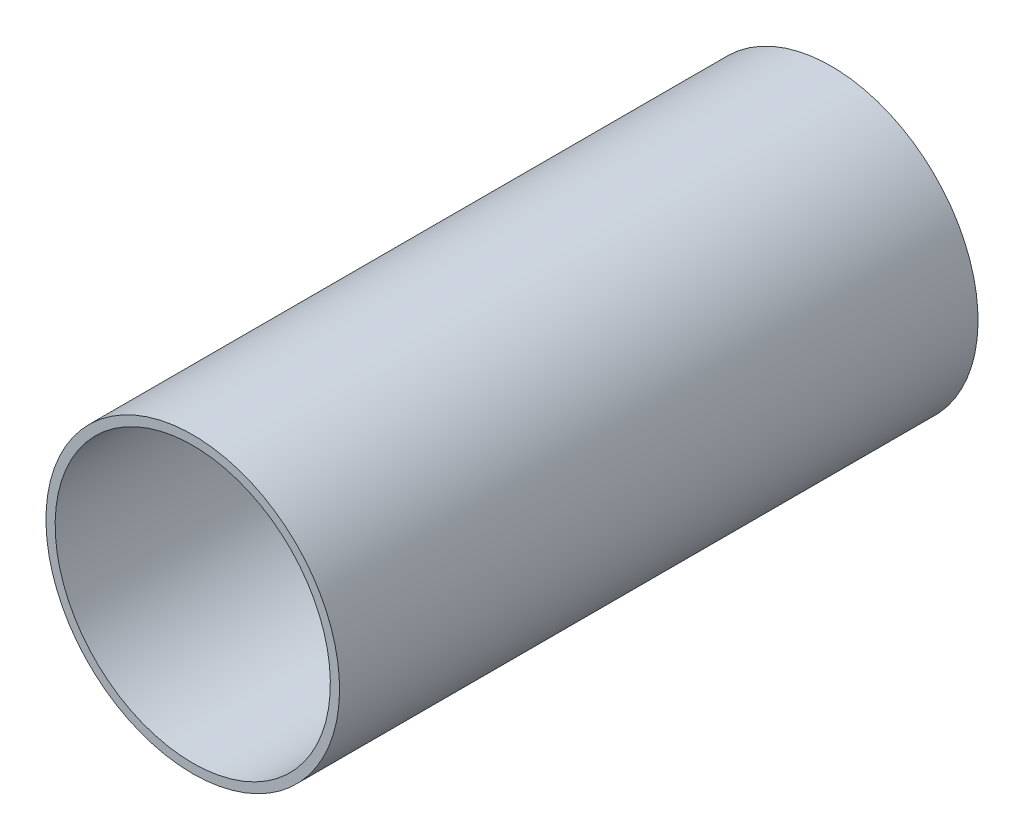
ISO-10303-21;
HEADER;
FILE_DESCRIPTION(('STEP AP214'),'2;1');
FILE_NAME('part.step','',(''),(''),'','','');
FILE_SCHEMA(('AUTOMOTIVE_DESIGN { 1 0 10303 214 1 1 1 1 }'));
ENDSEC;
DATA;
#1=APPLICATION_CONTEXT('core data for automotive mechanical design processes');
#2=APPLICATION_PROTOCOL_DEFINITION('international standard','automotive_design',2000,#1);
#3=PRODUCT_CONTEXT('',#1,'mechanical');
#4=PRODUCT('Part','Part','',(#3));
#5=PRODUCT_RELATED_PRODUCT_CATEGORY('part','',(#4));
#6=PRODUCT_DEFINITION_FORMATION('','',#4);
#7=PRODUCT_DEFINITION_CONTEXT('part definition',#1,'design');
#8=PRODUCT_DEFINITION('design','',#6,#7);
#9=PRODUCT_DEFINITION_SHAPE('','',#8);
#10=(LENGTH_UNIT() NAMED_UNIT(*) SI_UNIT(.MILLI.,.METRE.));
#11=(NAMED_UNIT(*) PLANE_ANGLE_UNIT() SI_UNIT($,.RADIAN.));
#12=(NAMED_UNIT(*) SI_UNIT($,.STERADIAN.) SOLID_ANGLE_UNIT());
#13=UNCERTAINTY_MEASURE_WITH_UNIT(LENGTH_MEASURE(1.E-05),#10,'distance_accuracy_value','');
#14=(GEOMETRIC_REPRESENTATION_CONTEXT(3) GLOBAL_UNCERTAINTY_ASSIGNED_CONTEXT((#13)) GLOBAL_UNIT_ASSIGNED_CONTEXT((#10,
#11,#12)) REPRESENTATION_CONTEXT('',''));
#15=CARTESIAN_POINT('',(0.,0.,0.));
#16=DIRECTION('',(0.,0.,1.));
#17=DIRECTION('',(1.,0.,0.));
#18=AXIS2_PLACEMENT_3D('',#15,#16,#17);
#19=CARTESIAN_POINT('',(132.08,-80.772,-0.045));
#20=DIRECTION('',(0.,0.,-1.));
#21=DIRECTION('',(0.,-1.,0.));
#22=AXIS2_PLACEMENT_3D('',#19,#20,#21);
#23=CYLINDRICAL_SURFACE('',#22,0.375);
#24=CARTESIAN_POINT('',(132.08,-80.772,-0.035));
#25=DIRECTION('',(0.,0.,-1.));
#26=DIRECTION('',(0.,-1.,0.));
#27=AXIS2_PLACEMENT_3D('',#24,#25,#26);
#28=CIRCLE('',#27,0.375);
#29=CARTESIAN_POINT('',(132.08,-81.147,-0.035));
#30=VERTEX_POINT('',#29);
#31=EDGE_CURVE('E65',#30,#30,#28,.T.);
#32=ORIENTED_EDGE('',*,*,#31,.T.);
#33=DIRECTION('',(0.,0.,1.));
#34=VECTOR('',#33,1.);
#35=CARTESIAN_POINT('',(132.08,-81.147,-0.045));
#36=LINE('',#35,#34);
#37=CARTESIAN_POINT('',(132.08,-81.147,1.705));
#38=VERTEX_POINT('',#37);
#39=EDGE_CURVE('E11',#30,#38,#36,.T.);
#40=ORIENTED_EDGE('',*,*,#39,.T.);
#41=CARTESIAN_POINT('',(132.08,-80.772,1.705));
#42=DIRECTION('',(0.,0.,-1.));
#43=DIRECTION('',(0.,-1.,0.));
#44=AXIS2_PLACEMENT_3D('',#41,#42,#43);
#45=CIRCLE('',#44,0.375);
#46=EDGE_CURVE('E26',#38,#38,#45,.T.);
#47=ORIENTED_EDGE('',*,*,#46,.F.);
#48=ORIENTED_EDGE('',*,*,#39,.F.);
#49=EDGE_LOOP('',(#32,#40,#47,#48));
#50=FACE_BOUND('',#49,.T.);
#51=ADVANCED_FACE('F17',(#50),#23,.F.);
#52=CARTESIAN_POINT('',(132.08,-81.172,1.705));
#53=DIRECTION('',(0.,0.,1.));
#54=DIRECTION('',(1.,0.,0.));
#55=AXIS2_PLACEMENT_3D('',#52,#53,#54);
#56=PLANE('',#55);
#57=ORIENTED_EDGE('',*,*,#46,.T.);
#58=EDGE_LOOP('',(#57));
#59=FACE_BOUND('',#58,.T.);
#60=CARTESIAN_POINT('',(132.08,-80.772,1.705));
#61=DIRECTION('',(0.,0.,1.));
#62=DIRECTION('',(0.,-1.,0.));
#63=AXIS2_PLACEMENT_3D('',#60,#61,#62);
#64=CIRCLE('',#63,0.4);
#65=CARTESIAN_POINT('',(132.08,-81.172,1.705));
#66=VERTEX_POINT('',#65);
#67=EDGE_CURVE('E57',#66,#66,#64,.T.);
#68=ORIENTED_EDGE('',*,*,#67,.T.);
#69=EDGE_LOOP('',(#68));
#70=FACE_BOUND('',#69,.T.);
#71=ADVANCED_FACE('F19',(#59,#70),#56,.T.);
#72=CARTESIAN_POINT('',(132.08,-81.172,-0.035));
#73=DIRECTION('',(0.,0.,1.));
#74=DIRECTION('',(1.,0.,0.));
#75=AXIS2_PLACEMENT_3D('',#72,#73,#74);
#76=PLANE('',#75);
#77=ORIENTED_EDGE('',*,*,#31,.F.);
#78=EDGE_LOOP('',(#77));
#79=FACE_BOUND('',#78,.T.);
#80=CARTESIAN_POINT('',(132.08,-80.772,-0.035));
#81=DIRECTION('',(0.,0.,1.));
#82=DIRECTION('',(0.,-1.,0.));
#83=AXIS2_PLACEMENT_3D('',#80,#81,#82);
#84=CIRCLE('',#83,0.4);
#85=CARTESIAN_POINT('',(132.08,-81.172,-0.035));
#86=VERTEX_POINT('',#85);
#87=EDGE_CURVE('E56',#86,#86,#84,.T.);
#88=ORIENTED_EDGE('',*,*,#87,.F.);
#89=EDGE_LOOP('',(#88));
#90=FACE_BOUND('',#89,.T.);
#91=ADVANCED_FACE('F75',(#79,#90),#76,.F.);
#92=CARTESIAN_POINT('',(132.08,-80.772,-0.035));
#93=DIRECTION('',(0.,0.,-1.));
#94=DIRECTION('',(0.,-1.,0.));
#95=AXIS2_PLACEMENT_3D('',#92,#93,#94);
#96=CYLINDRICAL_SURFACE('',#95,0.4);
#97=ORIENTED_EDGE('',*,*,#87,.T.);
#98=DIRECTION('',(0.,0.,1.));
#99=VECTOR('',#98,1.);
#100=CARTESIAN_POINT('',(132.08,-81.172,-0.035));
#101=LINE('',#100,#99);
#102=EDGE_CURVE('E53',#86,#66,#101,.T.);
#103=ORIENTED_EDGE('',*,*,#102,.T.);
#104=ORIENTED_EDGE('',*,*,#67,.F.);
#105=ORIENTED_EDGE('',*,*,#102,.F.);
#106=EDGE_LOOP('',(#97,#103,#104,#105));
#107=FACE_BOUND('',#106,.T.);
#108=ADVANCED_FACE('F54',(#107),#96,.T.);
#109=CLOSED_SHELL('',(#51,#71,#91,#108));
#110=MANIFOLD_SOLID_BREP('B1',#109);
#111=ADVANCED_BREP_SHAPE_REPRESENTATION('',(#18,#110),#14);
#112=SHAPE_DEFINITION_REPRESENTATION(#9,#111);
ENDSEC;
END-ISO-10303-21;
